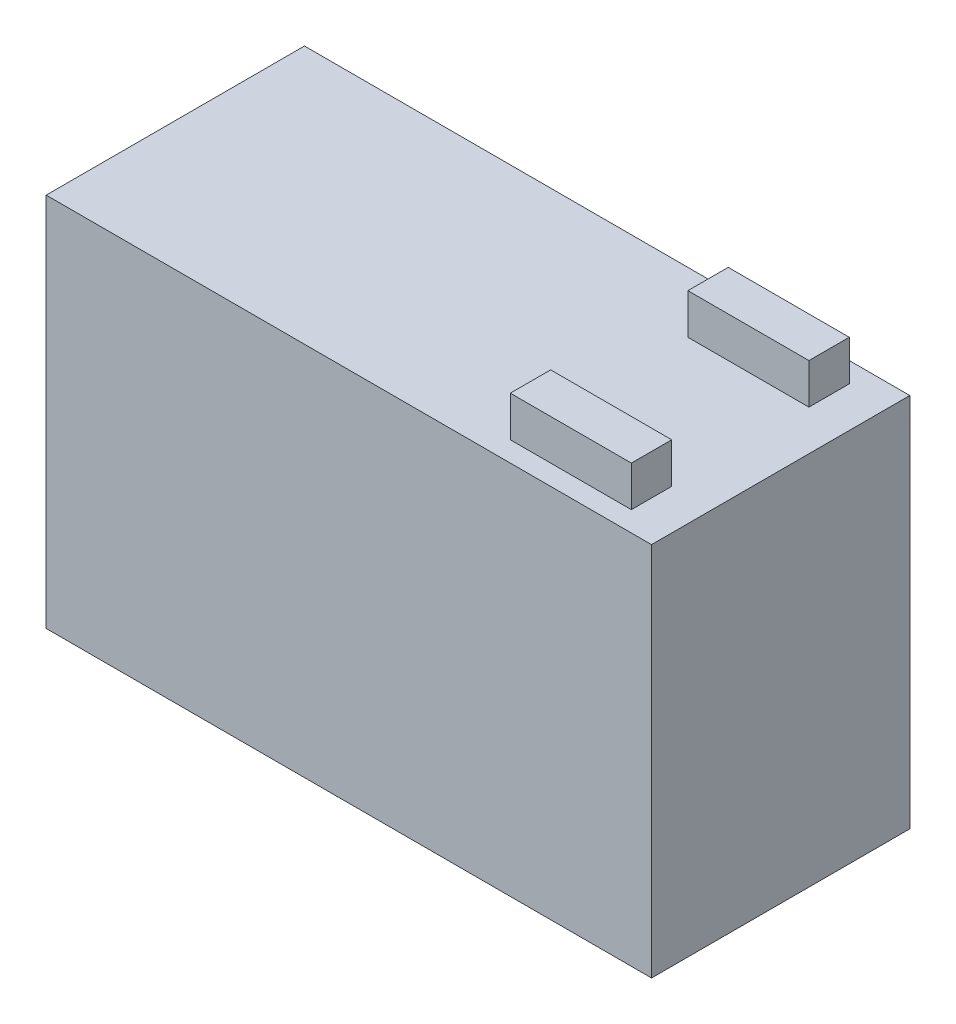
ISO-10303-21;
HEADER;
FILE_DESCRIPTION(('STEP AP214'),'2;1');
FILE_NAME('part.step','',(''),(''),'','','');
FILE_SCHEMA(('AUTOMOTIVE_DESIGN { 1 0 10303 214 1 1 1 1 }'));
ENDSEC;
DATA;
#1=APPLICATION_CONTEXT('core data for automotive mechanical design processes');
#2=APPLICATION_PROTOCOL_DEFINITION('international standard','automotive_design',2000,#1);
#3=PRODUCT_CONTEXT('',#1,'mechanical');
#4=PRODUCT('Part','Part','',(#3));
#5=PRODUCT_RELATED_PRODUCT_CATEGORY('part','',(#4));
#6=PRODUCT_DEFINITION_FORMATION('','',#4);
#7=PRODUCT_DEFINITION_CONTEXT('part definition',#1,'design');
#8=PRODUCT_DEFINITION('design','',#6,#7);
#9=PRODUCT_DEFINITION_SHAPE('','',#8);
#10=(LENGTH_UNIT() NAMED_UNIT(*) SI_UNIT(.MILLI.,.METRE.));
#11=(NAMED_UNIT(*) PLANE_ANGLE_UNIT() SI_UNIT($,.RADIAN.));
#12=(NAMED_UNIT(*) SI_UNIT($,.STERADIAN.) SOLID_ANGLE_UNIT());
#13=UNCERTAINTY_MEASURE_WITH_UNIT(LENGTH_MEASURE(1.E-05),#10,'distance_accuracy_value','');
#14=(GEOMETRIC_REPRESENTATION_CONTEXT(3) GLOBAL_UNCERTAINTY_ASSIGNED_CONTEXT((#13)) GLOBAL_UNIT_ASSIGNED_CONTEXT((#10,
#11,#12)) REPRESENTATION_CONTEXT('',''));
#15=CARTESIAN_POINT('',(0.,0.,0.));
#16=DIRECTION('',(0.,0.,1.));
#17=DIRECTION('',(1.,0.,0.));
#18=AXIS2_PLACEMENT_3D('',#15,#16,#17);
#19=CARTESIAN_POINT('',(0.,93.,0.));
#20=DIRECTION('',(0.,1.,0.));
#21=DIRECTION('',(0.,0.,1.));
#22=AXIS2_PLACEMENT_3D('',#19,#20,#21);
#23=PLANE('',#22);
#24=DIRECTION('',(0.,0.,1.));
#25=VECTOR('',#24,1.);
#26=CARTESIAN_POINT('',(105.269148016328,93.,-17.));
#27=LINE('',#26,#25);
#28=CARTESIAN_POINT('',(105.269148016328,93.,-27.));
#29=VERTEX_POINT('',#28);
#30=CARTESIAN_POINT('',(105.269148016328,93.,-17.));
#31=VERTEX_POINT('',#30);
#32=EDGE_CURVE('E126',#29,#31,#27,.T.);
#33=ORIENTED_EDGE('',*,*,#32,.T.);
#34=DIRECTION('',(-1.,0.,0.));
#35=VECTOR('',#34,1.);
#36=CARTESIAN_POINT('',(105.269148016328,93.,-17.));
#37=LINE('',#36,#35);
#38=CARTESIAN_POINT('',(75.2691480163278,93.,-17.));
#39=VERTEX_POINT('',#38);
#40=EDGE_CURVE('E140',#31,#39,#37,.T.);
#41=ORIENTED_EDGE('',*,*,#40,.T.);
#42=DIRECTION('',(0.,0.,-1.));
#43=VECTOR('',#42,1.);
#44=CARTESIAN_POINT('',(75.2691480163278,93.,-17.));
#45=LINE('',#44,#43);
#46=CARTESIAN_POINT('',(75.2691480163278,93.,-27.));
#47=VERTEX_POINT('',#46);
#48=EDGE_CURVE('E52',#39,#47,#45,.T.);
#49=ORIENTED_EDGE('',*,*,#48,.T.);
#50=DIRECTION('',(1.,0.,0.));
#51=VECTOR('',#50,1.);
#52=CARTESIAN_POINT('',(105.269148016328,93.,-27.));
#53=LINE('',#52,#51);
#54=EDGE_CURVE('E47',#47,#29,#53,.T.);
#55=ORIENTED_EDGE('',*,*,#54,.T.);
#56=EDGE_LOOP('',(#33,#41,#49,#55));
#57=FACE_BOUND('',#56,.T.);
#58=DIRECTION('',(0.,0.,1.));
#59=VECTOR('',#58,1.);
#60=CARTESIAN_POINT('',(-34.7308519836722,93.,-32.));
#61=LINE('',#60,#59);
#62=CARTESIAN_POINT('',(-34.7308519836722,93.,-32.));
#63=VERTEX_POINT('',#62);
#64=CARTESIAN_POINT('',(-34.7308519836722,93.,32.));
#65=VERTEX_POINT('',#64);
#66=EDGE_CURVE('E187',#63,#65,#61,.T.);
#67=ORIENTED_EDGE('',*,*,#66,.T.);
#68=DIRECTION('',(1.,0.,0.));
#69=VECTOR('',#68,1.);
#70=CARTESIAN_POINT('',(-34.7308519836722,93.,32.));
#71=LINE('',#70,#69);
#72=CARTESIAN_POINT('',(115.269148016328,93.,32.));
#73=VERTEX_POINT('',#72);
#74=EDGE_CURVE('E190',#65,#73,#71,.T.);
#75=ORIENTED_EDGE('',*,*,#74,.T.);
#76=DIRECTION('',(0.,0.,-1.));
#77=VECTOR('',#76,1.);
#78=CARTESIAN_POINT('',(115.269148016328,93.,-32.));
#79=LINE('',#78,#77);
#80=CARTESIAN_POINT('',(115.269148016328,93.,-32.));
#81=VERTEX_POINT('',#80);
#82=EDGE_CURVE('E193',#73,#81,#79,.T.);
#83=ORIENTED_EDGE('',*,*,#82,.T.);
#84=DIRECTION('',(-1.,0.,0.));
#85=VECTOR('',#84,1.);
#86=CARTESIAN_POINT('',(-34.7308519836722,93.,-32.));
#87=LINE('',#86,#85);
#88=EDGE_CURVE('E195',#81,#63,#87,.T.);
#89=ORIENTED_EDGE('',*,*,#88,.T.);
#90=EDGE_LOOP('',(#67,#75,#83,#89));
#91=FACE_BOUND('',#90,.T.);
#92=DIRECTION('',(-1.,0.,0.));
#93=VECTOR('',#92,1.);
#94=CARTESIAN_POINT('',(105.269148016328,93.,17.));
#95=LINE('',#94,#93);
#96=CARTESIAN_POINT('',(105.269148016328,93.,17.));
#97=VERTEX_POINT('',#96);
#98=CARTESIAN_POINT('',(75.2691480163278,93.,17.));
#99=VERTEX_POINT('',#98);
#100=EDGE_CURVE('E171',#97,#99,#95,.T.);
#101=ORIENTED_EDGE('',*,*,#100,.F.);
#102=DIRECTION('',(0.,0.,-1.));
#103=VECTOR('',#102,1.);
#104=CARTESIAN_POINT('',(105.269148016328,93.,17.));
#105=LINE('',#104,#103);
#106=CARTESIAN_POINT('',(105.269148016328,93.,27.));
#107=VERTEX_POINT('',#106);
#108=EDGE_CURVE('E129',#107,#97,#105,.T.);
#109=ORIENTED_EDGE('',*,*,#108,.F.);
#110=DIRECTION('',(1.,0.,0.));
#111=VECTOR('',#110,1.);
#112=CARTESIAN_POINT('',(105.269148016328,93.,27.));
#113=LINE('',#112,#111);
#114=CARTESIAN_POINT('',(75.2691480163278,93.,27.));
#115=VERTEX_POINT('',#114);
#116=EDGE_CURVE('E162',#115,#107,#113,.T.);
#117=ORIENTED_EDGE('',*,*,#116,.F.);
#118=DIRECTION('',(0.,0.,1.));
#119=VECTOR('',#118,1.);
#120=CARTESIAN_POINT('',(75.2691480163278,93.,17.));
#121=LINE('',#120,#119);
#122=EDGE_CURVE('E173',#99,#115,#121,.T.);
#123=ORIENTED_EDGE('',*,*,#122,.F.);
#124=EDGE_LOOP('',(#101,#109,#117,#123));
#125=FACE_BOUND('',#124,.T.);
#126=ADVANCED_FACE('F32',(#57,#91,#125),#23,.T.);
#127=CARTESIAN_POINT('',(-34.7308519836722,93.,-32.));
#128=DIRECTION('',(1.,0.,0.));
#129=DIRECTION('',(0.,0.,-1.));
#130=AXIS2_PLACEMENT_3D('',#127,#128,#129);
#131=PLANE('',#130);
#132=DIRECTION('',(0.,0.,1.));
#133=VECTOR('',#132,1.);
#134=CARTESIAN_POINT('',(-34.7308519836722,0.,-32.));
#135=LINE('',#134,#133);
#136=CARTESIAN_POINT('',(-34.7308519836722,0.,-32.));
#137=VERTEX_POINT('',#136);
#138=CARTESIAN_POINT('',(-34.7308519836722,0.,32.));
#139=VERTEX_POINT('',#138);
#140=EDGE_CURVE('E186',#137,#139,#135,.T.);
#141=ORIENTED_EDGE('',*,*,#140,.T.);
#142=DIRECTION('',(0.,-1.,0.));
#143=VECTOR('',#142,1.);
#144=CARTESIAN_POINT('',(-34.7308519836722,93.,32.));
#145=LINE('',#144,#143);
#146=EDGE_CURVE('E11',#65,#139,#145,.T.);
#147=ORIENTED_EDGE('',*,*,#146,.F.);
#148=ORIENTED_EDGE('',*,*,#66,.F.);
#149=DIRECTION('',(0.,-1.,0.));
#150=VECTOR('',#149,1.);
#151=CARTESIAN_POINT('',(-34.7308519836722,93.,-32.));
#152=LINE('',#151,#150);
#153=EDGE_CURVE('E197',#63,#137,#152,.T.);
#154=ORIENTED_EDGE('',*,*,#153,.T.);
#155=EDGE_LOOP('',(#141,#147,#148,#154));
#156=FACE_BOUND('',#155,.T.);
#157=ADVANCED_FACE('F34',(#156),#131,.F.);
#158=CARTESIAN_POINT('',(-34.7308519836722,93.,32.));
#159=DIRECTION('',(0.,0.,-1.));
#160=DIRECTION('',(-1.,0.,0.));
#161=AXIS2_PLACEMENT_3D('',#158,#159,#160);
#162=PLANE('',#161);
#163=DIRECTION('',(1.,0.,0.));
#164=VECTOR('',#163,1.);
#165=CARTESIAN_POINT('',(-34.7308519836722,0.,32.));
#166=LINE('',#165,#164);
#167=CARTESIAN_POINT('',(115.269148016328,0.,32.));
#168=VERTEX_POINT('',#167);
#169=EDGE_CURVE('E200',#139,#168,#166,.T.);
#170=ORIENTED_EDGE('',*,*,#169,.T.);
#171=DIRECTION('',(0.,-1.,0.));
#172=VECTOR('',#171,1.);
#173=CARTESIAN_POINT('',(115.269148016328,93.,32.));
#174=LINE('',#173,#172);
#175=EDGE_CURVE('E40',#73,#168,#174,.T.);
#176=ORIENTED_EDGE('',*,*,#175,.F.);
#177=ORIENTED_EDGE('',*,*,#74,.F.);
#178=ORIENTED_EDGE('',*,*,#146,.T.);
#179=EDGE_LOOP('',(#170,#176,#177,#178));
#180=FACE_BOUND('',#179,.T.);
#181=ADVANCED_FACE('F230',(#180),#162,.F.);
#182=CARTESIAN_POINT('',(115.269148016328,93.,-32.));
#183=DIRECTION('',(-1.,0.,0.));
#184=DIRECTION('',(0.,0.,1.));
#185=AXIS2_PLACEMENT_3D('',#182,#183,#184);
#186=PLANE('',#185);
#187=DIRECTION('',(0.,0.,-1.));
#188=VECTOR('',#187,1.);
#189=CARTESIAN_POINT('',(115.269148016328,0.,-32.));
#190=LINE('',#189,#188);
#191=CARTESIAN_POINT('',(115.269148016328,0.,-32.));
#192=VERTEX_POINT('',#191);
#193=EDGE_CURVE('E202',#168,#192,#190,.T.);
#194=ORIENTED_EDGE('',*,*,#193,.T.);
#195=DIRECTION('',(0.,-1.,0.));
#196=VECTOR('',#195,1.);
#197=CARTESIAN_POINT('',(115.269148016328,93.,-32.));
#198=LINE('',#197,#196);
#199=EDGE_CURVE('E207',#81,#192,#198,.T.);
#200=ORIENTED_EDGE('',*,*,#199,.F.);
#201=ORIENTED_EDGE('',*,*,#82,.F.);
#202=ORIENTED_EDGE('',*,*,#175,.T.);
#203=EDGE_LOOP('',(#194,#200,#201,#202));
#204=FACE_BOUND('',#203,.T.);
#205=ADVANCED_FACE('F214',(#204),#186,.F.);
#206=CARTESIAN_POINT('',(-34.7308519836722,93.,-32.));
#207=DIRECTION('',(0.,0.,1.));
#208=DIRECTION('',(1.,0.,0.));
#209=AXIS2_PLACEMENT_3D('',#206,#207,#208);
#210=PLANE('',#209);
#211=DIRECTION('',(-1.,0.,0.));
#212=VECTOR('',#211,1.);
#213=CARTESIAN_POINT('',(-34.7308519836722,0.,-32.));
#214=LINE('',#213,#212);
#215=EDGE_CURVE('E191',#192,#137,#214,.T.);
#216=ORIENTED_EDGE('',*,*,#215,.T.);
#217=ORIENTED_EDGE('',*,*,#153,.F.);
#218=ORIENTED_EDGE('',*,*,#88,.F.);
#219=ORIENTED_EDGE('',*,*,#199,.T.);
#220=EDGE_LOOP('',(#216,#217,#218,#219));
#221=FACE_BOUND('',#220,.T.);
#222=ADVANCED_FACE('F223',(#221),#210,.F.);
#223=CARTESIAN_POINT('',(0.,0.,0.));
#224=DIRECTION('',(0.,1.,0.));
#225=DIRECTION('',(0.,0.,1.));
#226=AXIS2_PLACEMENT_3D('',#223,#224,#225);
#227=PLANE('',#226);
#228=ORIENTED_EDGE('',*,*,#140,.F.);
#229=ORIENTED_EDGE('',*,*,#215,.F.);
#230=ORIENTED_EDGE('',*,*,#193,.F.);
#231=ORIENTED_EDGE('',*,*,#169,.F.);
#232=EDGE_LOOP('',(#228,#229,#230,#231));
#233=FACE_BOUND('',#232,.T.);
#234=ADVANCED_FACE('F220',(#233),#227,.F.);
#235=CARTESIAN_POINT('',(105.269148016328,103.,17.));
#236=DIRECTION('',(-1.,0.,0.));
#237=DIRECTION('',(0.,0.,1.));
#238=AXIS2_PLACEMENT_3D('',#235,#236,#237);
#239=PLANE('',#238);
#240=ORIENTED_EDGE('',*,*,#108,.T.);
#241=DIRECTION('',(0.,-1.,0.));
#242=VECTOR('',#241,1.);
#243=CARTESIAN_POINT('',(105.269148016328,103.,17.));
#244=LINE('',#243,#242);
#245=CARTESIAN_POINT('',(105.269148016328,103.,17.));
#246=VERTEX_POINT('',#245);
#247=EDGE_CURVE('E184',#246,#97,#244,.T.);
#248=ORIENTED_EDGE('',*,*,#247,.F.);
#249=DIRECTION('',(0.,0.,-1.));
#250=VECTOR('',#249,1.);
#251=CARTESIAN_POINT('',(105.269148016328,103.,17.));
#252=LINE('',#251,#250);
#253=CARTESIAN_POINT('',(105.269148016328,103.,27.));
#254=VERTEX_POINT('',#253);
#255=EDGE_CURVE('E158',#254,#246,#252,.T.);
#256=ORIENTED_EDGE('',*,*,#255,.F.);
#257=DIRECTION('',(0.,-1.,0.));
#258=VECTOR('',#257,1.);
#259=CARTESIAN_POINT('',(105.269148016328,103.,27.));
#260=LINE('',#259,#258);
#261=EDGE_CURVE('E168',#254,#107,#260,.T.);
#262=ORIENTED_EDGE('',*,*,#261,.T.);
#263=EDGE_LOOP('',(#240,#248,#256,#262));
#264=FACE_BOUND('',#263,.T.);
#265=ADVANCED_FACE('F243',(#264),#239,.F.);
#266=CARTESIAN_POINT('',(105.269148016328,103.,17.));
#267=DIRECTION('',(0.,0.,1.));
#268=DIRECTION('',(1.,0.,0.));
#269=AXIS2_PLACEMENT_3D('',#266,#267,#268);
#270=PLANE('',#269);
#271=ORIENTED_EDGE('',*,*,#100,.T.);
#272=DIRECTION('',(0.,-1.,0.));
#273=VECTOR('',#272,1.);
#274=CARTESIAN_POINT('',(75.2691480163278,103.,17.));
#275=LINE('',#274,#273);
#276=CARTESIAN_POINT('',(75.2691480163278,103.,17.));
#277=VERTEX_POINT('',#276);
#278=EDGE_CURVE('E181',#277,#99,#275,.T.);
#279=ORIENTED_EDGE('',*,*,#278,.F.);
#280=DIRECTION('',(-1.,0.,0.));
#281=VECTOR('',#280,1.);
#282=CARTESIAN_POINT('',(105.269148016328,103.,17.));
#283=LINE('',#282,#281);
#284=EDGE_CURVE('E161',#246,#277,#283,.T.);
#285=ORIENTED_EDGE('',*,*,#284,.F.);
#286=ORIENTED_EDGE('',*,*,#247,.T.);
#287=EDGE_LOOP('',(#271,#279,#285,#286));
#288=FACE_BOUND('',#287,.T.);
#289=ADVANCED_FACE('F262',(#288),#270,.F.);
#290=CARTESIAN_POINT('',(75.2691480163278,103.,17.));
#291=DIRECTION('',(1.,0.,0.));
#292=DIRECTION('',(0.,0.,-1.));
#293=AXIS2_PLACEMENT_3D('',#290,#291,#292);
#294=PLANE('',#293);
#295=ORIENTED_EDGE('',*,*,#122,.T.);
#296=DIRECTION('',(0.,-1.,0.));
#297=VECTOR('',#296,1.);
#298=CARTESIAN_POINT('',(75.2691480163278,103.,27.));
#299=LINE('',#298,#297);
#300=CARTESIAN_POINT('',(75.2691480163278,103.,27.));
#301=VERTEX_POINT('',#300);
#302=EDGE_CURVE('E179',#301,#115,#299,.T.);
#303=ORIENTED_EDGE('',*,*,#302,.F.);
#304=DIRECTION('',(0.,0.,1.));
#305=VECTOR('',#304,1.);
#306=CARTESIAN_POINT('',(75.2691480163278,103.,17.));
#307=LINE('',#306,#305);
#308=EDGE_CURVE('E164',#277,#301,#307,.T.);
#309=ORIENTED_EDGE('',*,*,#308,.F.);
#310=ORIENTED_EDGE('',*,*,#278,.T.);
#311=EDGE_LOOP('',(#295,#303,#309,#310));
#312=FACE_BOUND('',#311,.T.);
#313=ADVANCED_FACE('F269',(#312),#294,.F.);
#314=CARTESIAN_POINT('',(105.269148016328,103.,27.));
#315=DIRECTION('',(0.,0.,-1.));
#316=DIRECTION('',(-1.,0.,0.));
#317=AXIS2_PLACEMENT_3D('',#314,#315,#316);
#318=PLANE('',#317);
#319=ORIENTED_EDGE('',*,*,#116,.T.);
#320=ORIENTED_EDGE('',*,*,#261,.F.);
#321=DIRECTION('',(1.,0.,0.));
#322=VECTOR('',#321,1.);
#323=CARTESIAN_POINT('',(105.269148016328,103.,27.));
#324=LINE('',#323,#322);
#325=EDGE_CURVE('E166',#301,#254,#324,.T.);
#326=ORIENTED_EDGE('',*,*,#325,.F.);
#327=ORIENTED_EDGE('',*,*,#302,.T.);
#328=EDGE_LOOP('',(#319,#320,#326,#327));
#329=FACE_BOUND('',#328,.T.);
#330=ADVANCED_FACE('F276',(#329),#318,.F.);
#331=CARTESIAN_POINT('',(0.,103.,0.));
#332=DIRECTION('',(0.,-1.,0.));
#333=DIRECTION('',(0.,0.,-1.));
#334=AXIS2_PLACEMENT_3D('',#331,#332,#333);
#335=PLANE('',#334);
#336=ORIENTED_EDGE('',*,*,#255,.T.);
#337=ORIENTED_EDGE('',*,*,#284,.T.);
#338=ORIENTED_EDGE('',*,*,#308,.T.);
#339=ORIENTED_EDGE('',*,*,#325,.T.);
#340=EDGE_LOOP('',(#336,#337,#338,#339));
#341=FACE_BOUND('',#340,.T.);
#342=ADVANCED_FACE('F284',(#341),#335,.F.);
#343=CARTESIAN_POINT('',(105.269148016328,103.,-17.));
#344=DIRECTION('',(1.,0.,0.));
#345=DIRECTION('',(0.,0.,-1.));
#346=AXIS2_PLACEMENT_3D('',#343,#344,#345);
#347=PLANE('',#346);
#348=ORIENTED_EDGE('',*,*,#32,.F.);
#349=DIRECTION('',(0.,-1.,0.));
#350=VECTOR('',#349,1.);
#351=CARTESIAN_POINT('',(105.269148016328,103.,-27.));
#352=LINE('',#351,#350);
#353=CARTESIAN_POINT('',(105.269148016328,103.,-27.));
#354=VERTEX_POINT('',#353);
#355=EDGE_CURVE('E120',#354,#29,#352,.T.);
#356=ORIENTED_EDGE('',*,*,#355,.F.);
#357=DIRECTION('',(0.,0.,1.));
#358=VECTOR('',#357,1.);
#359=CARTESIAN_POINT('',(105.269148016328,103.,-17.));
#360=LINE('',#359,#358);
#361=CARTESIAN_POINT('',(105.269148016328,103.,-17.));
#362=VERTEX_POINT('',#361);
#363=EDGE_CURVE('E124',#354,#362,#360,.T.);
#364=ORIENTED_EDGE('',*,*,#363,.T.);
#365=DIRECTION('',(0.,-1.,0.));
#366=VECTOR('',#365,1.);
#367=CARTESIAN_POINT('',(105.269148016328,103.,-17.));
#368=LINE('',#367,#366);
#369=EDGE_CURVE('E148',#362,#31,#368,.T.);
#370=ORIENTED_EDGE('',*,*,#369,.T.);
#371=EDGE_LOOP('',(#348,#356,#364,#370));
#372=FACE_BOUND('',#371,.T.);
#373=ADVANCED_FACE('F122',(#372),#347,.T.);
#374=CARTESIAN_POINT('',(105.269148016328,103.,-27.));
#375=DIRECTION('',(0.,0.,-1.));
#376=DIRECTION('',(-1.,0.,0.));
#377=AXIS2_PLACEMENT_3D('',#374,#375,#376);
#378=PLANE('',#377);
#379=ORIENTED_EDGE('',*,*,#54,.F.);
#380=DIRECTION('',(0.,-1.,0.));
#381=VECTOR('',#380,1.);
#382=CARTESIAN_POINT('',(75.2691480163278,103.,-27.));
#383=LINE('',#382,#381);
#384=CARTESIAN_POINT('',(75.2691480163278,103.,-27.));
#385=VERTEX_POINT('',#384);
#386=EDGE_CURVE('E130',#385,#47,#383,.T.);
#387=ORIENTED_EDGE('',*,*,#386,.F.);
#388=DIRECTION('',(1.,0.,0.));
#389=VECTOR('',#388,1.);
#390=CARTESIAN_POINT('',(105.269148016328,103.,-27.));
#391=LINE('',#390,#389);
#392=EDGE_CURVE('E136',#385,#354,#391,.T.);
#393=ORIENTED_EDGE('',*,*,#392,.T.);
#394=ORIENTED_EDGE('',*,*,#355,.T.);
#395=EDGE_LOOP('',(#379,#387,#393,#394));
#396=FACE_BOUND('',#395,.T.);
#397=ADVANCED_FACE('F142',(#396),#378,.T.);
#398=CARTESIAN_POINT('',(75.2691480163278,103.,-17.));
#399=DIRECTION('',(-1.,0.,0.));
#400=DIRECTION('',(0.,0.,1.));
#401=AXIS2_PLACEMENT_3D('',#398,#399,#400);
#402=PLANE('',#401);
#403=ORIENTED_EDGE('',*,*,#48,.F.);
#404=DIRECTION('',(0.,-1.,0.));
#405=VECTOR('',#404,1.);
#406=CARTESIAN_POINT('',(75.2691480163278,103.,-17.));
#407=LINE('',#406,#405);
#408=CARTESIAN_POINT('',(75.2691480163278,103.,-17.));
#409=VERTEX_POINT('',#408);
#410=EDGE_CURVE('E154',#409,#39,#407,.T.);
#411=ORIENTED_EDGE('',*,*,#410,.F.);
#412=DIRECTION('',(0.,0.,-1.));
#413=VECTOR('',#412,1.);
#414=CARTESIAN_POINT('',(75.2691480163278,103.,-17.));
#415=LINE('',#414,#413);
#416=EDGE_CURVE('E143',#409,#385,#415,.T.);
#417=ORIENTED_EDGE('',*,*,#416,.T.);
#418=ORIENTED_EDGE('',*,*,#386,.T.);
#419=EDGE_LOOP('',(#403,#411,#417,#418));
#420=FACE_BOUND('',#419,.T.);
#421=ADVANCED_FACE('F305',(#420),#402,.T.);
#422=CARTESIAN_POINT('',(105.269148016328,103.,-17.));
#423=DIRECTION('',(0.,0.,1.));
#424=DIRECTION('',(1.,0.,0.));
#425=AXIS2_PLACEMENT_3D('',#422,#423,#424);
#426=PLANE('',#425);
#427=ORIENTED_EDGE('',*,*,#40,.F.);
#428=ORIENTED_EDGE('',*,*,#369,.F.);
#429=DIRECTION('',(-1.,0.,0.));
#430=VECTOR('',#429,1.);
#431=CARTESIAN_POINT('',(105.269148016328,103.,-17.));
#432=LINE('',#431,#430);
#433=EDGE_CURVE('E139',#362,#409,#432,.T.);
#434=ORIENTED_EDGE('',*,*,#433,.T.);
#435=ORIENTED_EDGE('',*,*,#410,.T.);
#436=EDGE_LOOP('',(#427,#428,#434,#435));
#437=FACE_BOUND('',#436,.T.);
#438=ADVANCED_FACE('F312',(#437),#426,.T.);
#439=CARTESIAN_POINT('',(0.,103.,0.));
#440=DIRECTION('',(0.,-1.,0.));
#441=DIRECTION('',(0.,0.,1.));
#442=AXIS2_PLACEMENT_3D('',#439,#440,#441);
#443=PLANE('',#442);
#444=ORIENTED_EDGE('',*,*,#363,.F.);
#445=ORIENTED_EDGE('',*,*,#392,.F.);
#446=ORIENTED_EDGE('',*,*,#416,.F.);
#447=ORIENTED_EDGE('',*,*,#433,.F.);
#448=EDGE_LOOP('',(#444,#445,#446,#447));
#449=FACE_BOUND('',#448,.T.);
#450=ADVANCED_FACE('F134',(#449),#443,.F.);
#451=CLOSED_SHELL('',(#126,#157,#181,#205,#222,#234,#265,#289,#313,#330,#342,#373,#397,#421,
#438,#450));
#452=MANIFOLD_SOLID_BREP('B2',#451);
#453=ADVANCED_BREP_SHAPE_REPRESENTATION('',(#18,#452),#14);
#454=SHAPE_DEFINITION_REPRESENTATION(#9,#453);
ENDSEC;
END-ISO-10303-21;
